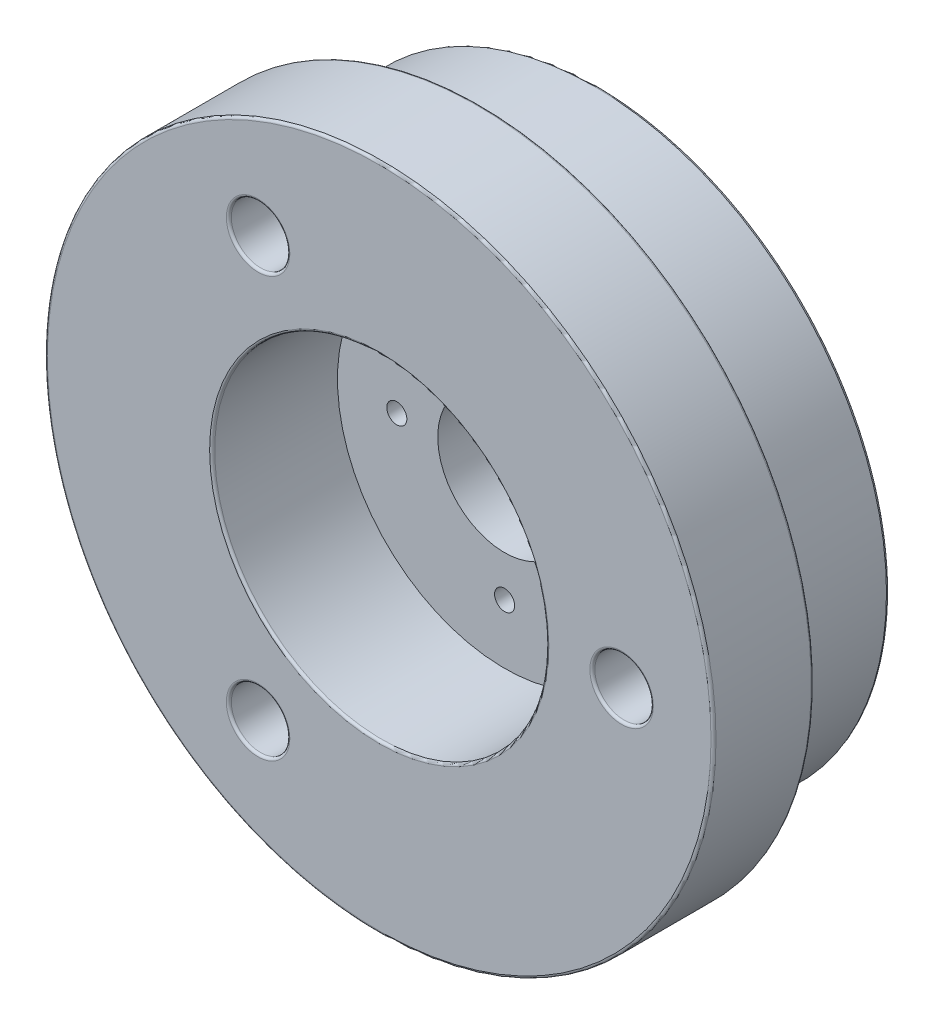
ISO-10303-21;
HEADER;
FILE_DESCRIPTION(('STEP AP214'),'2;1');
FILE_NAME('part.step','',(''),(''),'','','');
FILE_SCHEMA(('AUTOMOTIVE_DESIGN { 1 0 10303 214 1 1 1 1 }'));
ENDSEC;
DATA;
#1=APPLICATION_CONTEXT('core data for automotive mechanical design processes');
#2=APPLICATION_PROTOCOL_DEFINITION('international standard','automotive_design',2000,#1);
#3=PRODUCT_CONTEXT('',#1,'mechanical');
#4=PRODUCT('Part','Part','',(#3));
#5=PRODUCT_RELATED_PRODUCT_CATEGORY('part','',(#4));
#6=PRODUCT_DEFINITION_FORMATION('','',#4);
#7=PRODUCT_DEFINITION_CONTEXT('part definition',#1,'design');
#8=PRODUCT_DEFINITION('design','',#6,#7);
#9=PRODUCT_DEFINITION_SHAPE('','',#8);
#10=(LENGTH_UNIT() NAMED_UNIT(*) SI_UNIT(.MILLI.,.METRE.));
#11=(NAMED_UNIT(*) PLANE_ANGLE_UNIT() SI_UNIT($,.RADIAN.));
#12=(NAMED_UNIT(*) SI_UNIT($,.STERADIAN.) SOLID_ANGLE_UNIT());
#13=UNCERTAINTY_MEASURE_WITH_UNIT(LENGTH_MEASURE(1.E-05),#10,'distance_accuracy_value','');
#14=(GEOMETRIC_REPRESENTATION_CONTEXT(3) GLOBAL_UNCERTAINTY_ASSIGNED_CONTEXT((#13)) GLOBAL_UNIT_ASSIGNED_CONTEXT((#10,
#11,#12)) REPRESENTATION_CONTEXT('',''));
#15=CARTESIAN_POINT('',(0.,0.,0.));
#16=DIRECTION('',(0.,0.,1.));
#17=DIRECTION('',(1.,0.,0.));
#18=AXIS2_PLACEMENT_3D('',#15,#16,#17);
#19=CARTESIAN_POINT('',(-6.45,0.,-13.));
#20=DIRECTION('',(0.,0.,1.));
#21=DIRECTION('',(1.,0.,0.));
#22=AXIS2_PLACEMENT_3D('',#19,#20,#21);
#23=CYLINDRICAL_SURFACE('',#22,0.6);
#24=CARTESIAN_POINT('',(-6.45,0.,-12.85));
#25=DIRECTION('',(0.,0.,-1.));
#26=DIRECTION('',(-1.,0.,0.));
#27=AXIS2_PLACEMENT_3D('',#24,#25,#26);
#28=CIRCLE('',#27,0.6);
#29=CARTESIAN_POINT('',(-7.05,0.,-12.85));
#30=VERTEX_POINT('',#29);
#31=EDGE_CURVE('E87',#30,#30,#28,.T.);
#32=ORIENTED_EDGE('',*,*,#31,.T.);
#33=EDGE_LOOP('',(#32));
#34=FACE_BOUND('',#33,.T.);
#35=CARTESIAN_POINT('',(-6.45,0.,-7.5));
#36=DIRECTION('',(0.,0.,1.));
#37=DIRECTION('',(1.,0.,0.));
#38=AXIS2_PLACEMENT_3D('',#35,#36,#37);
#39=CIRCLE('',#38,0.6);
#40=CARTESIAN_POINT('',(-5.85,0.,-7.5));
#41=VERTEX_POINT('',#40);
#42=EDGE_CURVE('E147',#41,#41,#39,.T.);
#43=ORIENTED_EDGE('',*,*,#42,.T.);
#44=EDGE_LOOP('',(#43));
#45=FACE_BOUND('',#44,.T.);
#46=ADVANCED_FACE('F31',(#34,#45),#23,.F.);
#47=CARTESIAN_POINT('',(0.,0.,-13.));
#48=DIRECTION('',(0.,0.,1.));
#49=DIRECTION('',(1.,0.,0.));
#50=AXIS2_PLACEMENT_3D('',#47,#48,#49);
#51=CYLINDRICAL_SURFACE('',#50,4.);
#52=CARTESIAN_POINT('',(0.,0.,-12.85));
#53=DIRECTION('',(0.,0.,-1.));
#54=DIRECTION('',(-1.,0.,0.));
#55=AXIS2_PLACEMENT_3D('',#52,#53,#54);
#56=CIRCLE('',#55,4.);
#57=CARTESIAN_POINT('',(-4.,0.,-12.85));
#58=VERTEX_POINT('',#57);
#59=EDGE_CURVE('E66',#58,#58,#56,.T.);
#60=ORIENTED_EDGE('',*,*,#59,.T.);
#61=EDGE_LOOP('',(#60));
#62=FACE_BOUND('',#61,.T.);
#63=CARTESIAN_POINT('',(0.,0.,-7.5));
#64=DIRECTION('',(0.,0.,1.));
#65=DIRECTION('',(1.,0.,0.));
#66=AXIS2_PLACEMENT_3D('',#63,#64,#65);
#67=CIRCLE('',#66,4.);
#68=CARTESIAN_POINT('',(4.,0.,-7.5));
#69=VERTEX_POINT('',#68);
#70=EDGE_CURVE('E138',#69,#69,#67,.T.);
#71=ORIENTED_EDGE('',*,*,#70,.T.);
#72=EDGE_LOOP('',(#71));
#73=FACE_BOUND('',#72,.T.);
#74=ADVANCED_FACE('F182',(#62,#73),#51,.F.);
#75=CARTESIAN_POINT('',(0.,-6.45,-13.));
#76=DIRECTION('',(0.,0.,1.));
#77=DIRECTION('',(1.,0.,0.));
#78=AXIS2_PLACEMENT_3D('',#75,#76,#77);
#79=CYLINDRICAL_SURFACE('',#78,0.6);
#80=CARTESIAN_POINT('',(0.,-6.45,-12.85));
#81=DIRECTION('',(0.,0.,-1.));
#82=DIRECTION('',(-1.,0.,0.));
#83=AXIS2_PLACEMENT_3D('',#80,#81,#82);
#84=CIRCLE('',#83,0.6);
#85=CARTESIAN_POINT('',(-0.600000000000002,-6.45,-12.85));
#86=VERTEX_POINT('',#85);
#87=EDGE_CURVE('E63',#86,#86,#84,.T.);
#88=ORIENTED_EDGE('',*,*,#87,.T.);
#89=EDGE_LOOP('',(#88));
#90=FACE_BOUND('',#89,.T.);
#91=CARTESIAN_POINT('',(0.,-6.45,-7.5));
#92=DIRECTION('',(0.,0.,1.));
#93=DIRECTION('',(1.,0.,0.));
#94=AXIS2_PLACEMENT_3D('',#91,#92,#93);
#95=CIRCLE('',#94,0.6);
#96=CARTESIAN_POINT('',(0.599999999999997,-6.45,-7.5));
#97=VERTEX_POINT('',#96);
#98=EDGE_CURVE('E144',#97,#97,#95,.T.);
#99=ORIENTED_EDGE('',*,*,#98,.T.);
#100=EDGE_LOOP('',(#99));
#101=FACE_BOUND('',#100,.T.);
#102=ADVANCED_FACE('F188',(#90,#101),#79,.F.);
#103=CARTESIAN_POINT('',(6.45,0.,-13.));
#104=DIRECTION('',(0.,0.,1.));
#105=DIRECTION('',(1.,0.,0.));
#106=AXIS2_PLACEMENT_3D('',#103,#104,#105);
#107=CYLINDRICAL_SURFACE('',#106,0.6);
#108=CARTESIAN_POINT('',(6.45,0.,-12.85));
#109=DIRECTION('',(0.,0.,-1.));
#110=DIRECTION('',(-1.,0.,0.));
#111=AXIS2_PLACEMENT_3D('',#108,#109,#110);
#112=CIRCLE('',#111,0.6);
#113=CARTESIAN_POINT('',(5.85,0.,-12.85));
#114=VERTEX_POINT('',#113);
#115=EDGE_CURVE('E60',#114,#114,#112,.T.);
#116=ORIENTED_EDGE('',*,*,#115,.T.);
#117=EDGE_LOOP('',(#116));
#118=FACE_BOUND('',#117,.T.);
#119=CARTESIAN_POINT('',(6.45,0.,-7.5));
#120=DIRECTION('',(0.,0.,1.));
#121=DIRECTION('',(1.,0.,0.));
#122=AXIS2_PLACEMENT_3D('',#119,#120,#121);
#123=CIRCLE('',#122,0.6);
#124=CARTESIAN_POINT('',(7.05,0.,-7.5));
#125=VERTEX_POINT('',#124);
#126=EDGE_CURVE('E141',#125,#125,#123,.T.);
#127=ORIENTED_EDGE('',*,*,#126,.T.);
#128=EDGE_LOOP('',(#127));
#129=FACE_BOUND('',#128,.T.);
#130=ADVANCED_FACE('F442',(#118,#129),#107,.F.);
#131=CARTESIAN_POINT('',(0.,6.45,-13.));
#132=DIRECTION('',(0.,0.,1.));
#133=DIRECTION('',(1.,0.,0.));
#134=AXIS2_PLACEMENT_3D('',#131,#132,#133);
#135=CYLINDRICAL_SURFACE('',#134,0.6);
#136=CARTESIAN_POINT('',(0.,6.45,-12.85));
#137=DIRECTION('',(0.,0.,-1.));
#138=DIRECTION('',(-1.,0.,0.));
#139=AXIS2_PLACEMENT_3D('',#136,#137,#138);
#140=CIRCLE('',#139,0.6);
#141=CARTESIAN_POINT('',(-0.6,6.45,-12.85));
#142=VERTEX_POINT('',#141);
#143=EDGE_CURVE('E57',#142,#142,#140,.T.);
#144=ORIENTED_EDGE('',*,*,#143,.T.);
#145=EDGE_LOOP('',(#144));
#146=FACE_BOUND('',#145,.T.);
#147=CARTESIAN_POINT('',(0.,6.45,-7.5));
#148=DIRECTION('',(0.,0.,1.));
#149=DIRECTION('',(1.,0.,0.));
#150=AXIS2_PLACEMENT_3D('',#147,#148,#149);
#151=CIRCLE('',#150,0.6);
#152=CARTESIAN_POINT('',(0.6,6.45,-7.5));
#153=VERTEX_POINT('',#152);
#154=EDGE_CURVE('E150',#153,#153,#151,.T.);
#155=ORIENTED_EDGE('',*,*,#154,.T.);
#156=EDGE_LOOP('',(#155));
#157=FACE_BOUND('',#156,.T.);
#158=ADVANCED_FACE('F154',(#146,#157),#135,.F.);
#159=CARTESIAN_POINT('',(0.,0.,0.));
#160=DIRECTION('',(0.,0.,1.));
#161=DIRECTION('',(1.,0.,0.));
#162=AXIS2_PLACEMENT_3D('',#159,#160,#161);
#163=PLANE('',#162);
#164=CARTESIAN_POINT('',(0.,0.,0.));
#165=DIRECTION('',(0.,0.,1.));
#166=DIRECTION('',(1.,0.,0.));
#167=AXIS2_PLACEMENT_3D('',#164,#165,#166);
#168=CIRCLE('',#167,19.85);
#169=CARTESIAN_POINT('',(19.85,0.,0.));
#170=VERTEX_POINT('',#169);
#171=EDGE_CURVE('E38',#170,#170,#168,.T.);
#172=ORIENTED_EDGE('',*,*,#171,.T.);
#173=EDGE_LOOP('',(#172));
#174=FACE_BOUND('',#173,.T.);
#175=CARTESIAN_POINT('',(14.5,0.,0.));
#176=DIRECTION('',(0.,0.,1.));
#177=DIRECTION('',(1.,0.,0.));
#178=AXIS2_PLACEMENT_3D('',#175,#176,#177);
#179=CIRCLE('',#178,1.9);
#180=CARTESIAN_POINT('',(16.4,0.,0.));
#181=VERTEX_POINT('',#180);
#182=EDGE_CURVE('E42',#181,#181,#179,.F.);
#183=ORIENTED_EDGE('',*,*,#182,.T.);
#184=EDGE_LOOP('',(#183));
#185=FACE_BOUND('',#184,.T.);
#186=CARTESIAN_POINT('',(-7.24999999999999,-12.5573683548744,0.));
#187=DIRECTION('',(0.,0.,1.));
#188=DIRECTION('',(1.,0.,0.));
#189=AXIS2_PLACEMENT_3D('',#186,#187,#188);
#190=CIRCLE('',#189,1.89999999999998);
#191=CARTESIAN_POINT('',(-5.35000000000002,-12.5573683548744,0.));
#192=VERTEX_POINT('',#191);
#193=EDGE_CURVE('E46',#192,#192,#190,.F.);
#194=ORIENTED_EDGE('',*,*,#193,.T.);
#195=EDGE_LOOP('',(#194));
#196=FACE_BOUND('',#195,.T.);
#197=CARTESIAN_POINT('',(-7.25,12.5573683548744,0.));
#198=DIRECTION('',(0.,0.,1.));
#199=DIRECTION('',(1.,0.,0.));
#200=AXIS2_PLACEMENT_3D('',#197,#198,#199);
#201=CIRCLE('',#200,1.89999999999996);
#202=CARTESIAN_POINT('',(-5.35000000000004,12.5573683548744,0.));
#203=VERTEX_POINT('',#202);
#204=EDGE_CURVE('E51',#203,#203,#201,.F.);
#205=ORIENTED_EDGE('',*,*,#204,.T.);
#206=EDGE_LOOP('',(#205));
#207=FACE_BOUND('',#206,.T.);
#208=CARTESIAN_POINT('',(0.,0.,0.));
#209=DIRECTION('',(0.,0.,1.));
#210=DIRECTION('',(1.,0.,0.));
#211=AXIS2_PLACEMENT_3D('',#208,#209,#210);
#212=CIRCLE('',#211,10.15);
#213=CARTESIAN_POINT('',(10.15,0.,0.));
#214=VERTEX_POINT('',#213);
#215=EDGE_CURVE('E54',#214,#214,#212,.F.);
#216=ORIENTED_EDGE('',*,*,#215,.T.);
#217=EDGE_LOOP('',(#216));
#218=FACE_BOUND('',#217,.T.);
#219=ADVANCED_FACE('F210',(#174,#185,#196,#207,#218),#163,.T.);
#220=CARTESIAN_POINT('',(0.,0.,-13.));
#221=DIRECTION('',(0.,0.,-1.));
#222=DIRECTION('',(-1.,0.,0.));
#223=AXIS2_PLACEMENT_3D('',#220,#221,#222);
#224=CYLINDRICAL_SURFACE('',#223,20.);
#225=CARTESIAN_POINT('',(0.,0.,-5.85));
#226=DIRECTION('',(0.,0.,-1.));
#227=DIRECTION('',(-1.,0.,0.));
#228=AXIS2_PLACEMENT_3D('',#225,#226,#227);
#229=CIRCLE('',#228,20.);
#230=CARTESIAN_POINT('',(-20.,0.,-5.85));
#231=VERTEX_POINT('',#230);
#232=EDGE_CURVE('E117',#231,#231,#229,.F.);
#233=ORIENTED_EDGE('',*,*,#232,.T.);
#234=EDGE_LOOP('',(#233));
#235=FACE_BOUND('',#234,.T.);
#236=CARTESIAN_POINT('',(0.,0.,-0.149999999999999));
#237=DIRECTION('',(0.,0.,1.));
#238=DIRECTION('',(1.,0.,0.));
#239=AXIS2_PLACEMENT_3D('',#236,#237,#238);
#240=CIRCLE('',#239,20.);
#241=CARTESIAN_POINT('',(20.,0.,-0.149999999999999));
#242=VERTEX_POINT('',#241);
#243=EDGE_CURVE('E120',#242,#242,#240,.F.);
#244=ORIENTED_EDGE('',*,*,#243,.T.);
#245=EDGE_LOOP('',(#244));
#246=FACE_BOUND('',#245,.T.);
#247=ADVANCED_FACE('F206',(#235,#246),#224,.T.);
#248=CARTESIAN_POINT('',(-20.,0.,-6.));
#249=DIRECTION('',(0.,0.,-1.));
#250=DIRECTION('',(-1.,0.,0.));
#251=AXIS2_PLACEMENT_3D('',#248,#249,#250);
#252=PLANE('',#251);
#253=CARTESIAN_POINT('',(0.,0.,-6.));
#254=DIRECTION('',(0.,0.,-1.));
#255=DIRECTION('',(-1.,0.,0.));
#256=AXIS2_PLACEMENT_3D('',#253,#254,#255);
#257=CIRCLE('',#256,17.65);
#258=CARTESIAN_POINT('',(-17.65,0.,-6.));
#259=VERTEX_POINT('',#258);
#260=EDGE_CURVE('E123',#259,#259,#257,.F.);
#261=ORIENTED_EDGE('',*,*,#260,.T.);
#262=EDGE_LOOP('',(#261));
#263=FACE_BOUND('',#262,.T.);
#264=CARTESIAN_POINT('',(0.,0.,-6.));
#265=DIRECTION('',(0.,0.,-1.));
#266=DIRECTION('',(-1.,0.,0.));
#267=AXIS2_PLACEMENT_3D('',#264,#265,#266);
#268=CIRCLE('',#267,19.85);
#269=CARTESIAN_POINT('',(-19.85,0.,-6.));
#270=VERTEX_POINT('',#269);
#271=EDGE_CURVE('E126',#270,#270,#268,.T.);
#272=ORIENTED_EDGE('',*,*,#271,.T.);
#273=EDGE_LOOP('',(#272));
#274=FACE_BOUND('',#273,.T.);
#275=ADVANCED_FACE('F202',(#263,#274),#252,.T.);
#276=CARTESIAN_POINT('',(0.,0.,-13.));
#277=DIRECTION('',(0.,0.,-1.));
#278=DIRECTION('',(-1.,0.,0.));
#279=AXIS2_PLACEMENT_3D('',#276,#277,#278);
#280=CYLINDRICAL_SURFACE('',#279,17.5);
#281=CARTESIAN_POINT('',(0.,0.,-6.15));
#282=DIRECTION('',(0.,0.,-1.));
#283=DIRECTION('',(-1.,0.,0.));
#284=AXIS2_PLACEMENT_3D('',#281,#282,#283);
#285=CIRCLE('',#284,17.5);
#286=CARTESIAN_POINT('',(-17.5,0.,-6.15));
#287=VERTEX_POINT('',#286);
#288=EDGE_CURVE('E129',#287,#287,#285,.T.);
#289=ORIENTED_EDGE('',*,*,#288,.T.);
#290=EDGE_LOOP('',(#289));
#291=FACE_BOUND('',#290,.T.);
#292=CARTESIAN_POINT('',(0.,0.,-12.85));
#293=DIRECTION('',(0.,0.,-1.));
#294=DIRECTION('',(-1.,0.,0.));
#295=AXIS2_PLACEMENT_3D('',#292,#293,#294);
#296=CIRCLE('',#295,17.5);
#297=CARTESIAN_POINT('',(-17.5,0.,-12.85));
#298=VERTEX_POINT('',#297);
#299=EDGE_CURVE('E132',#298,#298,#296,.F.);
#300=ORIENTED_EDGE('',*,*,#299,.T.);
#301=EDGE_LOOP('',(#300));
#302=FACE_BOUND('',#301,.T.);
#303=ADVANCED_FACE('F198',(#291,#302),#280,.T.);
#304=CARTESIAN_POINT('',(-17.5,0.,-13.));
#305=DIRECTION('',(0.,0.,-1.));
#306=DIRECTION('',(-1.,0.,0.));
#307=AXIS2_PLACEMENT_3D('',#304,#305,#306);
#308=PLANE('',#307);
#309=CARTESIAN_POINT('',(0.,0.,-13.));
#310=DIRECTION('',(0.,0.,-1.));
#311=DIRECTION('',(-1.,0.,0.));
#312=AXIS2_PLACEMENT_3D('',#309,#310,#311);
#313=CIRCLE('',#312,17.35);
#314=CARTESIAN_POINT('',(-17.35,0.,-13.));
#315=VERTEX_POINT('',#314);
#316=EDGE_CURVE('E90',#315,#315,#313,.T.);
#317=ORIENTED_EDGE('',*,*,#316,.T.);
#318=EDGE_LOOP('',(#317));
#319=FACE_BOUND('',#318,.T.);
#320=CARTESIAN_POINT('',(-6.45,0.,-13.));
#321=DIRECTION('',(0.,0.,-1.));
#322=DIRECTION('',(-1.,0.,0.));
#323=AXIS2_PLACEMENT_3D('',#320,#321,#322);
#324=CIRCLE('',#323,0.75);
#325=CARTESIAN_POINT('',(-7.2,0.,-13.));
#326=VERTEX_POINT('',#325);
#327=EDGE_CURVE('E93',#326,#326,#324,.F.);
#328=ORIENTED_EDGE('',*,*,#327,.T.);
#329=EDGE_LOOP('',(#328));
#330=FACE_BOUND('',#329,.T.);
#331=CARTESIAN_POINT('',(14.5,0.,-13.));
#332=DIRECTION('',(0.,0.,-1.));
#333=DIRECTION('',(-1.,0.,0.));
#334=AXIS2_PLACEMENT_3D('',#331,#332,#333);
#335=CIRCLE('',#334,1.9);
#336=CARTESIAN_POINT('',(12.6,0.,-13.));
#337=VERTEX_POINT('',#336);
#338=EDGE_CURVE('E96',#337,#337,#335,.F.);
#339=ORIENTED_EDGE('',*,*,#338,.T.);
#340=EDGE_LOOP('',(#339));
#341=FACE_BOUND('',#340,.T.);
#342=CARTESIAN_POINT('',(-7.24999999999999,-12.5573683548744,-13.));
#343=DIRECTION('',(0.,0.,-1.));
#344=DIRECTION('',(-1.,0.,0.));
#345=AXIS2_PLACEMENT_3D('',#342,#343,#344);
#346=CIRCLE('',#345,1.89999999999998);
#347=CARTESIAN_POINT('',(-9.14999999999997,-12.5573683548744,-13.));
#348=VERTEX_POINT('',#347);
#349=EDGE_CURVE('E99',#348,#348,#346,.F.);
#350=ORIENTED_EDGE('',*,*,#349,.T.);
#351=EDGE_LOOP('',(#350));
#352=FACE_BOUND('',#351,.T.);
#353=CARTESIAN_POINT('',(-7.25,12.5573683548744,-13.));
#354=DIRECTION('',(0.,0.,-1.));
#355=DIRECTION('',(-1.,0.,0.));
#356=AXIS2_PLACEMENT_3D('',#353,#354,#355);
#357=CIRCLE('',#356,1.89999999999996);
#358=CARTESIAN_POINT('',(-9.14999999999996,12.5573683548744,-13.));
#359=VERTEX_POINT('',#358);
#360=EDGE_CURVE('E102',#359,#359,#357,.F.);
#361=ORIENTED_EDGE('',*,*,#360,.T.);
#362=EDGE_LOOP('',(#361));
#363=FACE_BOUND('',#362,.T.);
#364=CARTESIAN_POINT('',(0.,0.,-13.));
#365=DIRECTION('',(0.,0.,-1.));
#366=DIRECTION('',(-1.,0.,0.));
#367=AXIS2_PLACEMENT_3D('',#364,#365,#366);
#368=CIRCLE('',#367,4.15);
#369=CARTESIAN_POINT('',(-4.15,0.,-13.));
#370=VERTEX_POINT('',#369);
#371=EDGE_CURVE('E105',#370,#370,#368,.F.);
#372=ORIENTED_EDGE('',*,*,#371,.T.);
#373=EDGE_LOOP('',(#372));
#374=FACE_BOUND('',#373,.T.);
#375=CARTESIAN_POINT('',(0.,-6.45,-13.));
#376=DIRECTION('',(0.,0.,-1.));
#377=DIRECTION('',(-1.,0.,0.));
#378=AXIS2_PLACEMENT_3D('',#375,#376,#377);
#379=CIRCLE('',#378,0.75);
#380=CARTESIAN_POINT('',(-0.750000000000002,-6.45,-13.));
#381=VERTEX_POINT('',#380);
#382=EDGE_CURVE('E108',#381,#381,#379,.F.);
#383=ORIENTED_EDGE('',*,*,#382,.T.);
#384=EDGE_LOOP('',(#383));
#385=FACE_BOUND('',#384,.T.);
#386=CARTESIAN_POINT('',(6.45,0.,-13.));
#387=DIRECTION('',(0.,0.,-1.));
#388=DIRECTION('',(-1.,0.,0.));
#389=AXIS2_PLACEMENT_3D('',#386,#387,#388);
#390=CIRCLE('',#389,0.75);
#391=CARTESIAN_POINT('',(5.7,0.,-13.));
#392=VERTEX_POINT('',#391);
#393=EDGE_CURVE('E111',#392,#392,#390,.F.);
#394=ORIENTED_EDGE('',*,*,#393,.T.);
#395=EDGE_LOOP('',(#394));
#396=FACE_BOUND('',#395,.T.);
#397=CARTESIAN_POINT('',(0.,6.45,-13.));
#398=DIRECTION('',(0.,0.,-1.));
#399=DIRECTION('',(-1.,0.,0.));
#400=AXIS2_PLACEMENT_3D('',#397,#398,#399);
#401=CIRCLE('',#400,0.75);
#402=CARTESIAN_POINT('',(-0.75,6.45,-13.));
#403=VERTEX_POINT('',#402);
#404=EDGE_CURVE('E114',#403,#403,#401,.F.);
#405=ORIENTED_EDGE('',*,*,#404,.T.);
#406=EDGE_LOOP('',(#405));
#407=FACE_BOUND('',#406,.T.);
#408=ADVANCED_FACE('F194',(#319,#330,#341,#352,#363,#374,#385,#396,#407),#308,.T.);
#409=CARTESIAN_POINT('',(14.5,0.,-13.));
#410=DIRECTION('',(0.,0.,1.));
#411=DIRECTION('',(1.,0.,0.));
#412=AXIS2_PLACEMENT_3D('',#409,#410,#411);
#413=CYLINDRICAL_SURFACE('',#412,1.75);
#414=CARTESIAN_POINT('',(14.5,0.,-12.85));
#415=DIRECTION('',(0.,0.,-1.));
#416=DIRECTION('',(-1.,0.,0.));
#417=AXIS2_PLACEMENT_3D('',#414,#415,#416);
#418=CIRCLE('',#417,1.75);
#419=CARTESIAN_POINT('',(12.75,0.,-12.85));
#420=VERTEX_POINT('',#419);
#421=EDGE_CURVE('E81',#420,#420,#418,.T.);
#422=ORIENTED_EDGE('',*,*,#421,.T.);
#423=EDGE_LOOP('',(#422));
#424=FACE_BOUND('',#423,.T.);
#425=CARTESIAN_POINT('',(14.5,0.,-0.149999999999999));
#426=DIRECTION('',(0.,0.,1.));
#427=DIRECTION('',(1.,0.,0.));
#428=AXIS2_PLACEMENT_3D('',#425,#426,#427);
#429=CIRCLE('',#428,1.75);
#430=CARTESIAN_POINT('',(16.25,0.,-0.149999999999999));
#431=VERTEX_POINT('',#430);
#432=EDGE_CURVE('E84',#431,#431,#429,.T.);
#433=ORIENTED_EDGE('',*,*,#432,.T.);
#434=EDGE_LOOP('',(#433));
#435=FACE_BOUND('',#434,.T.);
#436=ADVANCED_FACE('F197',(#424,#435),#413,.F.);
#437=CARTESIAN_POINT('',(-7.24999999999999,-12.5573683548744,-13.));
#438=DIRECTION('',(0.,0.,1.));
#439=DIRECTION('',(1.,0.,0.));
#440=AXIS2_PLACEMENT_3D('',#437,#438,#439);
#441=CYLINDRICAL_SURFACE('',#440,1.74999999999998);
#442=CARTESIAN_POINT('',(-7.24999999999999,-12.5573683548744,-12.85));
#443=DIRECTION('',(0.,0.,-1.));
#444=DIRECTION('',(-1.,0.,0.));
#445=AXIS2_PLACEMENT_3D('',#442,#443,#444);
#446=CIRCLE('',#445,1.74999999999998);
#447=CARTESIAN_POINT('',(-8.99999999999997,-12.5573683548744,-12.85));
#448=VERTEX_POINT('',#447);
#449=EDGE_CURVE('E75',#448,#448,#446,.T.);
#450=ORIENTED_EDGE('',*,*,#449,.T.);
#451=EDGE_LOOP('',(#450));
#452=FACE_BOUND('',#451,.T.);
#453=CARTESIAN_POINT('',(-7.24999999999999,-12.5573683548744,-0.149999999999999));
#454=DIRECTION('',(0.,0.,1.));
#455=DIRECTION('',(1.,0.,0.));
#456=AXIS2_PLACEMENT_3D('',#453,#454,#455);
#457=CIRCLE('',#456,1.74999999999998);
#458=CARTESIAN_POINT('',(-5.50000000000002,-12.5573683548744,-0.149999999999999));
#459=VERTEX_POINT('',#458);
#460=EDGE_CURVE('E78',#459,#459,#457,.T.);
#461=ORIENTED_EDGE('',*,*,#460,.T.);
#462=EDGE_LOOP('',(#461));
#463=FACE_BOUND('',#462,.T.);
#464=ADVANCED_FACE('F178',(#452,#463),#441,.F.);
#465=CARTESIAN_POINT('',(-7.25,12.5573683548744,-13.));
#466=DIRECTION('',(0.,0.,1.));
#467=DIRECTION('',(1.,0.,0.));
#468=AXIS2_PLACEMENT_3D('',#465,#466,#467);
#469=CYLINDRICAL_SURFACE('',#468,1.74999999999996);
#470=CARTESIAN_POINT('',(-7.25,12.5573683548744,-12.85));
#471=DIRECTION('',(0.,0.,-1.));
#472=DIRECTION('',(-1.,0.,0.));
#473=AXIS2_PLACEMENT_3D('',#470,#471,#472);
#474=CIRCLE('',#473,1.74999999999996);
#475=CARTESIAN_POINT('',(-8.99999999999996,12.5573683548744,-12.85));
#476=VERTEX_POINT('',#475);
#477=EDGE_CURVE('E69',#476,#476,#474,.T.);
#478=ORIENTED_EDGE('',*,*,#477,.T.);
#479=EDGE_LOOP('',(#478));
#480=FACE_BOUND('',#479,.T.);
#481=CARTESIAN_POINT('',(-7.25,12.5573683548744,-0.149999999999999));
#482=DIRECTION('',(0.,0.,1.));
#483=DIRECTION('',(1.,0.,0.));
#484=AXIS2_PLACEMENT_3D('',#481,#482,#483);
#485=CIRCLE('',#484,1.74999999999996);
#486=CARTESIAN_POINT('',(-5.50000000000004,12.5573683548744,-0.149999999999999));
#487=VERTEX_POINT('',#486);
#488=EDGE_CURVE('E72',#487,#487,#485,.T.);
#489=ORIENTED_EDGE('',*,*,#488,.T.);
#490=EDGE_LOOP('',(#489));
#491=FACE_BOUND('',#490,.T.);
#492=ADVANCED_FACE('F173',(#480,#491),#469,.F.);
#493=CARTESIAN_POINT('',(0.,0.,-7.5));
#494=DIRECTION('',(0.,0.,1.));
#495=DIRECTION('',(1.,0.,0.));
#496=AXIS2_PLACEMENT_3D('',#493,#494,#495);
#497=CYLINDRICAL_SURFACE('',#496,10.);
#498=CARTESIAN_POINT('',(0.,0.,-0.149999999999999));
#499=DIRECTION('',(0.,0.,1.));
#500=DIRECTION('',(1.,0.,0.));
#501=AXIS2_PLACEMENT_3D('',#498,#499,#500);
#502=CIRCLE('',#501,10.);
#503=CARTESIAN_POINT('',(10.,0.,-0.149999999999999));
#504=VERTEX_POINT('',#503);
#505=EDGE_CURVE('E10',#504,#504,#502,.T.);
#506=ORIENTED_EDGE('',*,*,#505,.T.);
#507=EDGE_LOOP('',(#506));
#508=FACE_BOUND('',#507,.T.);
#509=CARTESIAN_POINT('',(0.,0.,-7.5));
#510=DIRECTION('',(0.,0.,1.));
#511=DIRECTION('',(1.,0.,0.));
#512=AXIS2_PLACEMENT_3D('',#509,#510,#511);
#513=CIRCLE('',#512,10.);
#514=CARTESIAN_POINT('',(10.,0.,-7.5));
#515=VERTEX_POINT('',#514);
#516=EDGE_CURVE('E135',#515,#515,#513,.T.);
#517=ORIENTED_EDGE('',*,*,#516,.F.);
#518=EDGE_LOOP('',(#517));
#519=FACE_BOUND('',#518,.T.);
#520=ADVANCED_FACE('F160',(#508,#519),#497,.F.);
#521=CARTESIAN_POINT('',(0.,0.,-7.5));
#522=DIRECTION('',(0.,0.,1.));
#523=DIRECTION('',(1.,0.,0.));
#524=AXIS2_PLACEMENT_3D('',#521,#522,#523);
#525=PLANE('',#524);
#526=ORIENTED_EDGE('',*,*,#154,.F.);
#527=EDGE_LOOP('',(#526));
#528=FACE_BOUND('',#527,.T.);
#529=ORIENTED_EDGE('',*,*,#42,.F.);
#530=EDGE_LOOP('',(#529));
#531=FACE_BOUND('',#530,.T.);
#532=ORIENTED_EDGE('',*,*,#98,.F.);
#533=EDGE_LOOP('',(#532));
#534=FACE_BOUND('',#533,.T.);
#535=ORIENTED_EDGE('',*,*,#126,.F.);
#536=EDGE_LOOP('',(#535));
#537=FACE_BOUND('',#536,.T.);
#538=ORIENTED_EDGE('',*,*,#70,.F.);
#539=EDGE_LOOP('',(#538));
#540=FACE_BOUND('',#539,.T.);
#541=ORIENTED_EDGE('',*,*,#516,.T.);
#542=EDGE_LOOP('',(#541));
#543=FACE_BOUND('',#542,.T.);
#544=ADVANCED_FACE('F156',(#528,#531,#534,#537,#540,#543),#525,.T.);
#545=CARTESIAN_POINT('',(0.,0.,-6.15));
#546=DIRECTION('',(0.,0.,-1.));
#547=DIRECTION('',(-1.,0.,0.));
#548=AXIS2_PLACEMENT_3D('',#545,#546,#547);
#549=TOROIDAL_SURFACE('',#548,17.65,0.15);
#550=ORIENTED_EDGE('',*,*,#260,.F.);
#551=EDGE_LOOP('',(#550));
#552=FACE_BOUND('',#551,.T.);
#553=ORIENTED_EDGE('',*,*,#288,.F.);
#554=EDGE_LOOP('',(#553));
#555=FACE_BOUND('',#554,.T.);
#556=ADVANCED_FACE('F159',(#552,#555),#549,.F.);
#557=CARTESIAN_POINT('',(0.,0.,-5.85));
#558=DIRECTION('',(0.,0.,-1.));
#559=DIRECTION('',(-1.,0.,0.));
#560=AXIS2_PLACEMENT_3D('',#557,#558,#559);
#561=TOROIDAL_SURFACE('',#560,19.85,0.15);
#562=ORIENTED_EDGE('',*,*,#232,.F.);
#563=EDGE_LOOP('',(#562));
#564=FACE_BOUND('',#563,.T.);
#565=ORIENTED_EDGE('',*,*,#271,.F.);
#566=EDGE_LOOP('',(#565));
#567=FACE_BOUND('',#566,.T.);
#568=ADVANCED_FACE('F216',(#564,#567),#561,.T.);
#569=CARTESIAN_POINT('',(0.,0.,-12.85));
#570=DIRECTION('',(0.,0.,-1.));
#571=DIRECTION('',(-1.,0.,0.));
#572=AXIS2_PLACEMENT_3D('',#569,#570,#571);
#573=TOROIDAL_SURFACE('',#572,17.35,0.15);
#574=ORIENTED_EDGE('',*,*,#299,.F.);
#575=EDGE_LOOP('',(#574));
#576=FACE_BOUND('',#575,.T.);
#577=ORIENTED_EDGE('',*,*,#316,.F.);
#578=EDGE_LOOP('',(#577));
#579=FACE_BOUND('',#578,.T.);
#580=ADVANCED_FACE('F220',(#576,#579),#573,.T.);
#581=CARTESIAN_POINT('',(-6.45,0.,-12.85));
#582=DIRECTION('',(0.,0.,-1.));
#583=DIRECTION('',(-1.,0.,0.));
#584=AXIS2_PLACEMENT_3D('',#581,#582,#583);
#585=TOROIDAL_SURFACE('',#584,0.75,0.15);
#586=ORIENTED_EDGE('',*,*,#31,.F.);
#587=EDGE_LOOP('',(#586));
#588=FACE_BOUND('',#587,.T.);
#589=ORIENTED_EDGE('',*,*,#327,.F.);
#590=EDGE_LOOP('',(#589));
#591=FACE_BOUND('',#590,.T.);
#592=ADVANCED_FACE('F224',(#588,#591),#585,.T.);
#593=CARTESIAN_POINT('',(14.5,0.,-12.85));
#594=DIRECTION('',(0.,0.,-1.));
#595=DIRECTION('',(-1.,0.,0.));
#596=AXIS2_PLACEMENT_3D('',#593,#594,#595);
#597=TOROIDAL_SURFACE('',#596,1.9,0.15);
#598=ORIENTED_EDGE('',*,*,#421,.F.);
#599=EDGE_LOOP('',(#598));
#600=FACE_BOUND('',#599,.T.);
#601=ORIENTED_EDGE('',*,*,#338,.F.);
#602=EDGE_LOOP('',(#601));
#603=FACE_BOUND('',#602,.T.);
#604=ADVANCED_FACE('F228',(#600,#603),#597,.T.);
#605=CARTESIAN_POINT('',(-7.24999999999999,-12.5573683548744,-12.85));
#606=DIRECTION('',(0.,0.,-1.));
#607=DIRECTION('',(-1.,0.,0.));
#608=AXIS2_PLACEMENT_3D('',#605,#606,#607);
#609=TOROIDAL_SURFACE('',#608,1.89999999999998,0.15);
#610=ORIENTED_EDGE('',*,*,#449,.F.);
#611=EDGE_LOOP('',(#610));
#612=FACE_BOUND('',#611,.T.);
#613=ORIENTED_EDGE('',*,*,#349,.F.);
#614=EDGE_LOOP('',(#613));
#615=FACE_BOUND('',#614,.T.);
#616=ADVANCED_FACE('F232',(#612,#615),#609,.T.);
#617=CARTESIAN_POINT('',(-7.25,12.5573683548744,-12.85));
#618=DIRECTION('',(0.,0.,-1.));
#619=DIRECTION('',(-1.,0.,0.));
#620=AXIS2_PLACEMENT_3D('',#617,#618,#619);
#621=TOROIDAL_SURFACE('',#620,1.89999999999996,0.15);
#622=ORIENTED_EDGE('',*,*,#477,.F.);
#623=EDGE_LOOP('',(#622));
#624=FACE_BOUND('',#623,.T.);
#625=ORIENTED_EDGE('',*,*,#360,.F.);
#626=EDGE_LOOP('',(#625));
#627=FACE_BOUND('',#626,.T.);
#628=ADVANCED_FACE('F236',(#624,#627),#621,.T.);
#629=CARTESIAN_POINT('',(0.,0.,-12.85));
#630=DIRECTION('',(0.,0.,-1.));
#631=DIRECTION('',(-1.,0.,0.));
#632=AXIS2_PLACEMENT_3D('',#629,#630,#631);
#633=TOROIDAL_SURFACE('',#632,4.15,0.15);
#634=ORIENTED_EDGE('',*,*,#59,.F.);
#635=EDGE_LOOP('',(#634));
#636=FACE_BOUND('',#635,.T.);
#637=ORIENTED_EDGE('',*,*,#371,.F.);
#638=EDGE_LOOP('',(#637));
#639=FACE_BOUND('',#638,.T.);
#640=ADVANCED_FACE('F240',(#636,#639),#633,.T.);
#641=CARTESIAN_POINT('',(0.,-6.45,-12.85));
#642=DIRECTION('',(0.,0.,-1.));
#643=DIRECTION('',(-1.,0.,0.));
#644=AXIS2_PLACEMENT_3D('',#641,#642,#643);
#645=TOROIDAL_SURFACE('',#644,0.75,0.15);
#646=ORIENTED_EDGE('',*,*,#87,.F.);
#647=EDGE_LOOP('',(#646));
#648=FACE_BOUND('',#647,.T.);
#649=ORIENTED_EDGE('',*,*,#382,.F.);
#650=EDGE_LOOP('',(#649));
#651=FACE_BOUND('',#650,.T.);
#652=ADVANCED_FACE('F244',(#648,#651),#645,.T.);
#653=CARTESIAN_POINT('',(6.45,0.,-12.85));
#654=DIRECTION('',(0.,0.,-1.));
#655=DIRECTION('',(-1.,0.,0.));
#656=AXIS2_PLACEMENT_3D('',#653,#654,#655);
#657=TOROIDAL_SURFACE('',#656,0.75,0.15);
#658=ORIENTED_EDGE('',*,*,#115,.F.);
#659=EDGE_LOOP('',(#658));
#660=FACE_BOUND('',#659,.T.);
#661=ORIENTED_EDGE('',*,*,#393,.F.);
#662=EDGE_LOOP('',(#661));
#663=FACE_BOUND('',#662,.T.);
#664=ADVANCED_FACE('F248',(#660,#663),#657,.T.);
#665=CARTESIAN_POINT('',(0.,6.45,-12.85));
#666=DIRECTION('',(0.,0.,-1.));
#667=DIRECTION('',(-1.,0.,0.));
#668=AXIS2_PLACEMENT_3D('',#665,#666,#667);
#669=TOROIDAL_SURFACE('',#668,0.75,0.15);
#670=ORIENTED_EDGE('',*,*,#143,.F.);
#671=EDGE_LOOP('',(#670));
#672=FACE_BOUND('',#671,.T.);
#673=ORIENTED_EDGE('',*,*,#404,.F.);
#674=EDGE_LOOP('',(#673));
#675=FACE_BOUND('',#674,.T.);
#676=ADVANCED_FACE('F252',(#672,#675),#669,.T.);
#677=CARTESIAN_POINT('',(0.,0.,-0.149999999999999));
#678=DIRECTION('',(0.,0.,1.));
#679=DIRECTION('',(1.,0.,0.));
#680=AXIS2_PLACEMENT_3D('',#677,#678,#679);
#681=TOROIDAL_SURFACE('',#680,19.85,0.15);
#682=ORIENTED_EDGE('',*,*,#171,.F.);
#683=EDGE_LOOP('',(#682));
#684=FACE_BOUND('',#683,.T.);
#685=ORIENTED_EDGE('',*,*,#243,.F.);
#686=EDGE_LOOP('',(#685));
#687=FACE_BOUND('',#686,.T.);
#688=ADVANCED_FACE('F256',(#684,#687),#681,.T.);
#689=CARTESIAN_POINT('',(14.5,0.,-0.149999999999999));
#690=DIRECTION('',(0.,0.,1.));
#691=DIRECTION('',(1.,0.,0.));
#692=AXIS2_PLACEMENT_3D('',#689,#690,#691);
#693=TOROIDAL_SURFACE('',#692,1.9,0.15);
#694=ORIENTED_EDGE('',*,*,#182,.F.);
#695=EDGE_LOOP('',(#694));
#696=FACE_BOUND('',#695,.T.);
#697=ORIENTED_EDGE('',*,*,#432,.F.);
#698=EDGE_LOOP('',(#697));
#699=FACE_BOUND('',#698,.T.);
#700=ADVANCED_FACE('F260',(#696,#699),#693,.T.);
#701=CARTESIAN_POINT('',(-7.24999999999999,-12.5573683548744,-0.149999999999999));
#702=DIRECTION('',(0.,0.,1.));
#703=DIRECTION('',(1.,0.,0.));
#704=AXIS2_PLACEMENT_3D('',#701,#702,#703);
#705=TOROIDAL_SURFACE('',#704,1.89999999999998,0.15);
#706=ORIENTED_EDGE('',*,*,#193,.F.);
#707=EDGE_LOOP('',(#706));
#708=FACE_BOUND('',#707,.T.);
#709=ORIENTED_EDGE('',*,*,#460,.F.);
#710=EDGE_LOOP('',(#709));
#711=FACE_BOUND('',#710,.T.);
#712=ADVANCED_FACE('F264',(#708,#711),#705,.T.);
#713=CARTESIAN_POINT('',(-7.25,12.5573683548744,-0.149999999999999));
#714=DIRECTION('',(0.,0.,1.));
#715=DIRECTION('',(1.,0.,0.));
#716=AXIS2_PLACEMENT_3D('',#713,#714,#715);
#717=TOROIDAL_SURFACE('',#716,1.89999999999996,0.15);
#718=ORIENTED_EDGE('',*,*,#204,.F.);
#719=EDGE_LOOP('',(#718));
#720=FACE_BOUND('',#719,.T.);
#721=ORIENTED_EDGE('',*,*,#488,.F.);
#722=EDGE_LOOP('',(#721));
#723=FACE_BOUND('',#722,.T.);
#724=ADVANCED_FACE('F267',(#720,#723),#717,.T.);
#725=CARTESIAN_POINT('',(0.,0.,-0.149999999999999));
#726=DIRECTION('',(0.,0.,1.));
#727=DIRECTION('',(1.,0.,0.));
#728=AXIS2_PLACEMENT_3D('',#725,#726,#727);
#729=TOROIDAL_SURFACE('',#728,10.15,0.15);
#730=ORIENTED_EDGE('',*,*,#215,.F.);
#731=EDGE_LOOP('',(#730));
#732=FACE_BOUND('',#731,.T.);
#733=ORIENTED_EDGE('',*,*,#505,.F.);
#734=EDGE_LOOP('',(#733));
#735=FACE_BOUND('',#734,.T.);
#736=ADVANCED_FACE('F33',(#732,#735),#729,.T.);
#737=CLOSED_SHELL('',(#46,#74,#102,#130,#158,#219,#247,#275,#303,#408,#436,#464,#492,#520,#544,
#556,#568,#580,#592,#604,#616,#628,#640,#652,#664,#676,#688,#700,#712,#724,#736));
#738=MANIFOLD_SOLID_BREP('B2',#737);
#739=ADVANCED_BREP_SHAPE_REPRESENTATION('',(#18,#738),#14);
#740=SHAPE_DEFINITION_REPRESENTATION(#9,#739);
ENDSEC;
END-ISO-10303-21;
